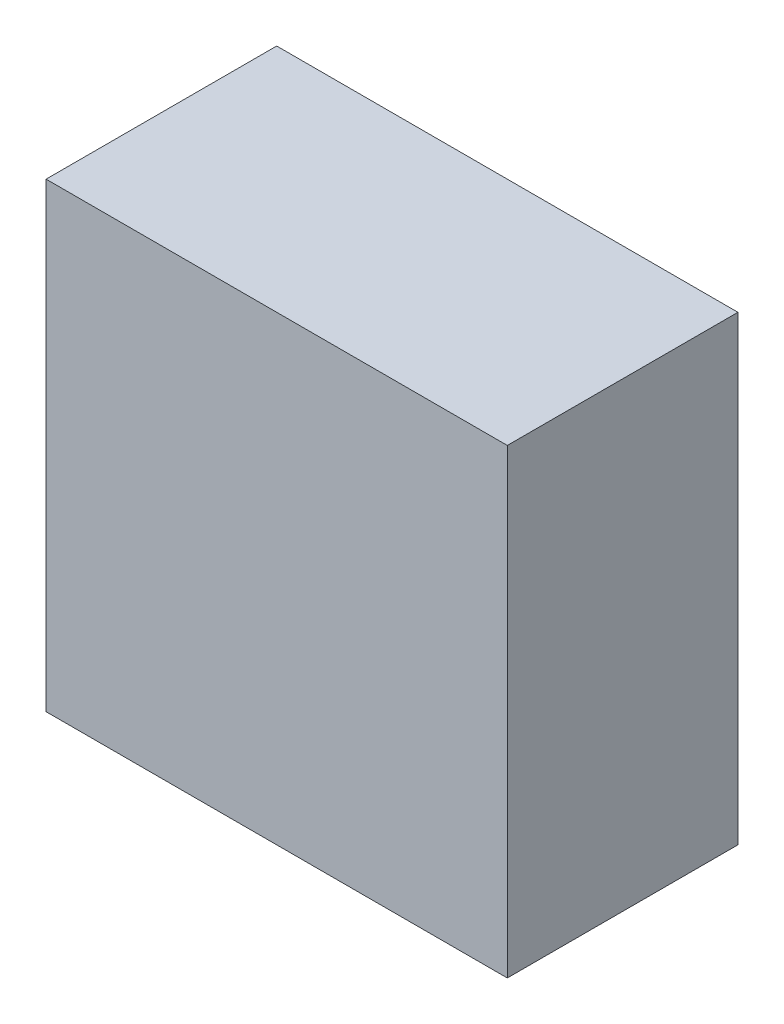
ISO-10303-21;
HEADER;
FILE_DESCRIPTION(('STEP AP214'),'2;1');
FILE_NAME('part.step','',(''),(''),'','','');
FILE_SCHEMA(('AUTOMOTIVE_DESIGN { 1 0 10303 214 1 1 1 1 }'));
ENDSEC;
DATA;
#1=APPLICATION_CONTEXT('core data for automotive mechanical design processes');
#2=APPLICATION_PROTOCOL_DEFINITION('international standard','automotive_design',2000,#1);
#3=PRODUCT_CONTEXT('',#1,'mechanical');
#4=PRODUCT('Part','Part','',(#3));
#5=PRODUCT_RELATED_PRODUCT_CATEGORY('part','',(#4));
#6=PRODUCT_DEFINITION_FORMATION('','',#4);
#7=PRODUCT_DEFINITION_CONTEXT('part definition',#1,'design');
#8=PRODUCT_DEFINITION('design','',#6,#7);
#9=PRODUCT_DEFINITION_SHAPE('','',#8);
#10=(LENGTH_UNIT() NAMED_UNIT(*) SI_UNIT(.MILLI.,.METRE.));
#11=(NAMED_UNIT(*) PLANE_ANGLE_UNIT() SI_UNIT($,.RADIAN.));
#12=(NAMED_UNIT(*) SI_UNIT($,.STERADIAN.) SOLID_ANGLE_UNIT());
#13=UNCERTAINTY_MEASURE_WITH_UNIT(LENGTH_MEASURE(1.E-05),#10,'distance_accuracy_value','');
#14=(GEOMETRIC_REPRESENTATION_CONTEXT(3) GLOBAL_UNCERTAINTY_ASSIGNED_CONTEXT((#13)) GLOBAL_UNIT_ASSIGNED_CONTEXT((#10,
#11,#12)) REPRESENTATION_CONTEXT('',''));
#15=CARTESIAN_POINT('',(0.,0.,0.));
#16=DIRECTION('',(0.,0.,1.));
#17=DIRECTION('',(1.,0.,0.));
#18=AXIS2_PLACEMENT_3D('',#15,#16,#17);
#19=CARTESIAN_POINT('',(0.,0.,2.75));
#20=DIRECTION('',(0.,0.,-1.));
#21=DIRECTION('',(-1.,0.,0.));
#22=AXIS2_PLACEMENT_3D('',#19,#20,#21);
#23=PLANE('',#22);
#24=DIRECTION('',(1.,0.,0.));
#25=VECTOR('',#24,1.);
#26=CARTESIAN_POINT('',(42.,165.941489418563,2.75));
#27=LINE('',#26,#25);
#28=CARTESIAN_POINT('',(38.,165.941489418563,2.75));
#29=VERTEX_POINT('',#28);
#30=CARTESIAN_POINT('',(42.,165.941489418563,2.75));
#31=VERTEX_POINT('',#30);
#32=EDGE_CURVE('E80',#29,#31,#27,.T.);
#33=ORIENTED_EDGE('',*,*,#32,.T.);
#34=DIRECTION('',(0.,1.,0.));
#35=VECTOR('',#34,1.);
#36=CARTESIAN_POINT('',(42.,169.941489418563,2.75));
#37=LINE('',#36,#35);
#38=CARTESIAN_POINT('',(42.,169.941489418563,2.75));
#39=VERTEX_POINT('',#38);
#40=EDGE_CURVE('E55',#31,#39,#37,.T.);
#41=ORIENTED_EDGE('',*,*,#40,.T.);
#42=DIRECTION('',(1.,0.,0.));
#43=VECTOR('',#42,1.);
#44=CARTESIAN_POINT('',(42.,169.941489418563,2.75));
#45=LINE('',#44,#43);
#46=CARTESIAN_POINT('',(38.,169.941489418563,2.75));
#47=VERTEX_POINT('',#46);
#48=EDGE_CURVE('E57',#39,#47,#45,.F.);
#49=ORIENTED_EDGE('',*,*,#48,.T.);
#50=DIRECTION('',(0.,1.,0.));
#51=VECTOR('',#50,1.);
#52=CARTESIAN_POINT('',(38.,169.941489418563,2.75));
#53=LINE('',#52,#51);
#54=EDGE_CURVE('E20',#47,#29,#53,.F.);
#55=ORIENTED_EDGE('',*,*,#54,.T.);
#56=EDGE_LOOP('',(#33,#41,#49,#55));
#57=FACE_BOUND('',#56,.T.);
#58=ADVANCED_FACE('F17',(#57),#23,.F.);
#59=CARTESIAN_POINT('',(38.,169.941489418563,2.75));
#60=DIRECTION('',(1.,0.,0.));
#61=DIRECTION('',(0.,0.,-1.));
#62=AXIS2_PLACEMENT_3D('',#59,#60,#61);
#63=PLANE('',#62);
#64=DIRECTION('',(0.,0.,1.));
#65=VECTOR('',#64,1.);
#66=CARTESIAN_POINT('',(38.,165.941489418563,2.75));
#67=LINE('',#66,#65);
#68=CARTESIAN_POINT('',(38.,165.941489418563,0.75));
#69=VERTEX_POINT('',#68);
#70=EDGE_CURVE('E68',#69,#29,#67,.T.);
#71=ORIENTED_EDGE('',*,*,#70,.T.);
#72=ORIENTED_EDGE('',*,*,#54,.F.);
#73=DIRECTION('',(0.,0.,-1.));
#74=VECTOR('',#73,1.);
#75=CARTESIAN_POINT('',(38.,169.941489418563,2.75));
#76=LINE('',#75,#74);
#77=CARTESIAN_POINT('',(38.,169.941489418563,0.75));
#78=VERTEX_POINT('',#77);
#79=EDGE_CURVE('E63',#47,#78,#76,.T.);
#80=ORIENTED_EDGE('',*,*,#79,.T.);
#81=DIRECTION('',(0.,1.,0.));
#82=VECTOR('',#81,1.);
#83=CARTESIAN_POINT('',(38.,0.,0.75));
#84=LINE('',#83,#82);
#85=EDGE_CURVE('E83',#69,#78,#84,.T.);
#86=ORIENTED_EDGE('',*,*,#85,.F.);
#87=EDGE_LOOP('',(#71,#72,#80,#86));
#88=FACE_BOUND('',#87,.T.);
#89=ADVANCED_FACE('F65',(#88),#63,.F.);
#90=CARTESIAN_POINT('',(42.,169.941489418563,2.75));
#91=DIRECTION('',(0.,-1.,0.));
#92=DIRECTION('',(0.,0.,-1.));
#93=AXIS2_PLACEMENT_3D('',#90,#91,#92);
#94=PLANE('',#93);
#95=ORIENTED_EDGE('',*,*,#79,.F.);
#96=ORIENTED_EDGE('',*,*,#48,.F.);
#97=DIRECTION('',(0.,0.,1.));
#98=VECTOR('',#97,1.);
#99=CARTESIAN_POINT('',(42.,169.941489418563,2.75));
#100=LINE('',#99,#98);
#101=CARTESIAN_POINT('',(42.,169.941489418563,0.75));
#102=VERTEX_POINT('',#101);
#103=EDGE_CURVE('E75',#39,#102,#100,.F.);
#104=ORIENTED_EDGE('',*,*,#103,.T.);
#105=DIRECTION('',(-1.,0.,0.));
#106=VECTOR('',#105,1.);
#107=CARTESIAN_POINT('',(0.,169.941489418563,0.75));
#108=LINE('',#107,#106);
#109=EDGE_CURVE('E72',#78,#102,#108,.F.);
#110=ORIENTED_EDGE('',*,*,#109,.F.);
#111=EDGE_LOOP('',(#95,#96,#104,#110));
#112=FACE_BOUND('',#111,.T.);
#113=ADVANCED_FACE('F70',(#112),#94,.F.);
#114=CARTESIAN_POINT('',(42.,169.941489418563,2.75));
#115=DIRECTION('',(-1.,0.,0.));
#116=DIRECTION('',(0.,0.,1.));
#117=AXIS2_PLACEMENT_3D('',#114,#115,#116);
#118=PLANE('',#117);
#119=ORIENTED_EDGE('',*,*,#103,.F.);
#120=ORIENTED_EDGE('',*,*,#40,.F.);
#121=DIRECTION('',(0.,0.,1.));
#122=VECTOR('',#121,1.);
#123=CARTESIAN_POINT('',(42.,165.941489418563,2.75));
#124=LINE('',#123,#122);
#125=CARTESIAN_POINT('',(42.,165.941489418563,0.75));
#126=VERTEX_POINT('',#125);
#127=EDGE_CURVE('E35',#31,#126,#124,.F.);
#128=ORIENTED_EDGE('',*,*,#127,.T.);
#129=DIRECTION('',(0.,1.,0.));
#130=VECTOR('',#129,1.);
#131=CARTESIAN_POINT('',(42.,0.,0.75));
#132=LINE('',#131,#130);
#133=EDGE_CURVE('E26',#102,#126,#132,.F.);
#134=ORIENTED_EDGE('',*,*,#133,.F.);
#135=EDGE_LOOP('',(#119,#120,#128,#134));
#136=FACE_BOUND('',#135,.T.);
#137=ADVANCED_FACE('F89',(#136),#118,.F.);
#138=CARTESIAN_POINT('',(42.,165.941489418563,2.75));
#139=DIRECTION('',(0.,1.,0.));
#140=DIRECTION('',(0.,0.,1.));
#141=AXIS2_PLACEMENT_3D('',#138,#139,#140);
#142=PLANE('',#141);
#143=ORIENTED_EDGE('',*,*,#127,.F.);
#144=ORIENTED_EDGE('',*,*,#32,.F.);
#145=ORIENTED_EDGE('',*,*,#70,.F.);
#146=DIRECTION('',(-1.,0.,0.));
#147=VECTOR('',#146,1.);
#148=CARTESIAN_POINT('',(0.,165.941489418563,0.75));
#149=LINE('',#148,#147);
#150=EDGE_CURVE('E11',#126,#69,#149,.T.);
#151=ORIENTED_EDGE('',*,*,#150,.F.);
#152=EDGE_LOOP('',(#143,#144,#145,#151));
#153=FACE_BOUND('',#152,.T.);
#154=ADVANCED_FACE('F91',(#153),#142,.F.);
#155=CARTESIAN_POINT('',(0.,0.,0.75));
#156=DIRECTION('',(0.,0.,-1.));
#157=DIRECTION('',(-1.,0.,0.));
#158=AXIS2_PLACEMENT_3D('',#155,#156,#157);
#159=PLANE('',#158);
#160=ORIENTED_EDGE('',*,*,#133,.T.);
#161=ORIENTED_EDGE('',*,*,#150,.T.);
#162=ORIENTED_EDGE('',*,*,#85,.T.);
#163=ORIENTED_EDGE('',*,*,#109,.T.);
#164=EDGE_LOOP('',(#160,#161,#162,#163));
#165=FACE_BOUND('',#164,.T.);
#166=ADVANCED_FACE('F88',(#165),#159,.T.);
#167=CLOSED_SHELL('',(#58,#89,#113,#137,#154,#166));
#168=MANIFOLD_SOLID_BREP('B1',#167);
#169=ADVANCED_BREP_SHAPE_REPRESENTATION('',(#18,#168),#14);
#170=SHAPE_DEFINITION_REPRESENTATION(#9,#169);
ENDSEC;
END-ISO-10303-21;
